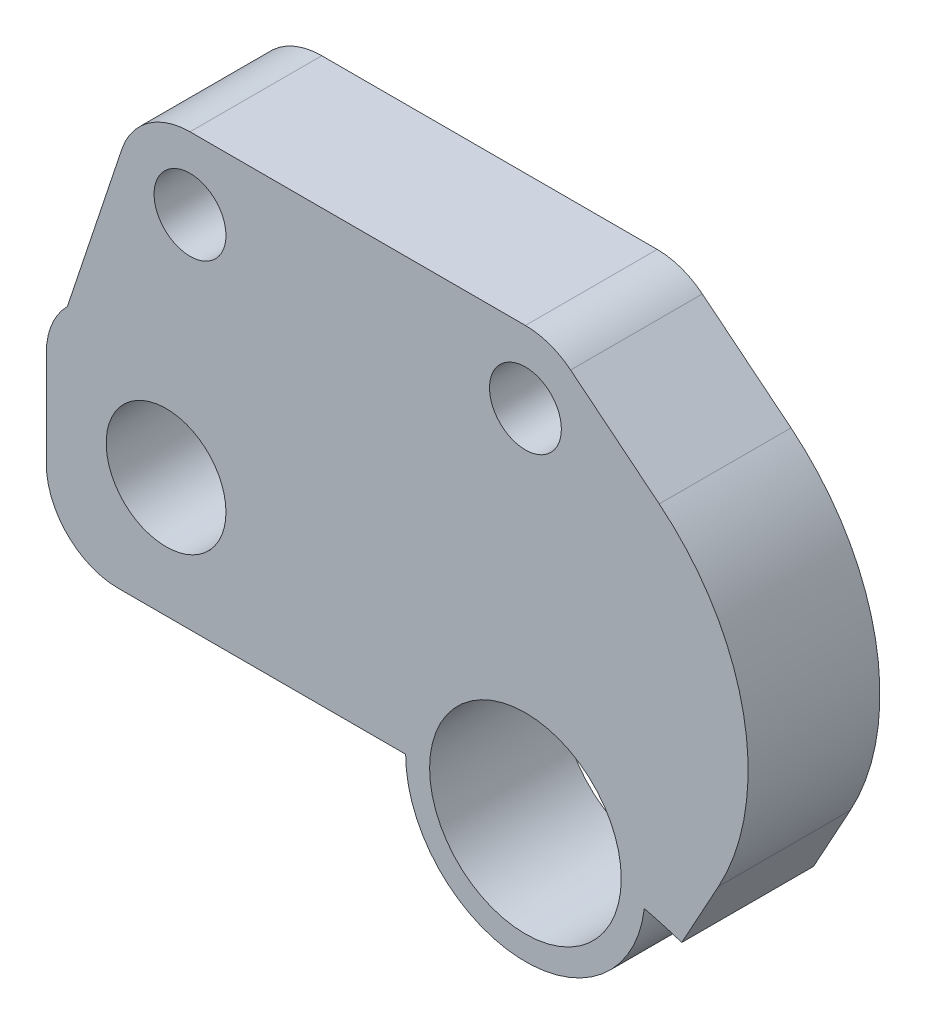
ISO-10303-21;
HEADER;
FILE_DESCRIPTION(('STEP AP214'),'2;1');
FILE_NAME('part.step','',(''),(''),'','','');
FILE_SCHEMA(('AUTOMOTIVE_DESIGN { 1 0 10303 214 1 1 1 1 }'));
ENDSEC;
DATA;
#1=APPLICATION_CONTEXT('core data for automotive mechanical design processes');
#2=APPLICATION_PROTOCOL_DEFINITION('international standard','automotive_design',2000,#1);
#3=PRODUCT_CONTEXT('',#1,'mechanical');
#4=PRODUCT('Part','Part','',(#3));
#5=PRODUCT_RELATED_PRODUCT_CATEGORY('part','',(#4));
#6=PRODUCT_DEFINITION_FORMATION('','',#4);
#7=PRODUCT_DEFINITION_CONTEXT('part definition',#1,'design');
#8=PRODUCT_DEFINITION('design','',#6,#7);
#9=PRODUCT_DEFINITION_SHAPE('','',#8);
#10=(LENGTH_UNIT() NAMED_UNIT(*) SI_UNIT(.MILLI.,.METRE.));
#11=(NAMED_UNIT(*) PLANE_ANGLE_UNIT() SI_UNIT($,.RADIAN.));
#12=(NAMED_UNIT(*) SI_UNIT($,.STERADIAN.) SOLID_ANGLE_UNIT());
#13=UNCERTAINTY_MEASURE_WITH_UNIT(LENGTH_MEASURE(1.E-05),#10,'distance_accuracy_value','');
#14=(GEOMETRIC_REPRESENTATION_CONTEXT(3) GLOBAL_UNCERTAINTY_ASSIGNED_CONTEXT((#13)) GLOBAL_UNIT_ASSIGNED_CONTEXT((#10,
#11,#12)) REPRESENTATION_CONTEXT('',''));
#15=CARTESIAN_POINT('',(0.,0.,0.));
#16=DIRECTION('',(0.,0.,1.));
#17=DIRECTION('',(1.,0.,0.));
#18=AXIS2_PLACEMENT_3D('',#15,#16,#17);
#19=CARTESIAN_POINT('',(0.,0.,5.5));
#20=DIRECTION('',(0.,0.,-1.));
#21=DIRECTION('',(-1.,0.,0.));
#22=AXIS2_PLACEMENT_3D('',#19,#20,#21);
#23=CYLINDRICAL_SURFACE('',#22,20.95);
#24=CARTESIAN_POINT('',(0.,0.,0.));
#25=DIRECTION('',(0.,0.,1.));
#26=DIRECTION('',(1.,0.,0.));
#27=AXIS2_PLACEMENT_3D('',#24,#25,#26);
#28=CIRCLE('',#27,20.95);
#29=CARTESIAN_POINT('',(6.52630372987979,19.90753273576,0.));
#30=VERTEX_POINT('',#29);
#31=CARTESIAN_POINT('',(4.96427219059639,20.3533412887828,0.));
#32=VERTEX_POINT('',#31);
#33=EDGE_CURVE('E143',#30,#32,#28,.T.);
#34=ORIENTED_EDGE('',*,*,#33,.F.);
#35=DIRECTION('',(0.,0.,1.));
#36=VECTOR('',#35,1.);
#37=CARTESIAN_POINT('',(6.52630372987979,19.90753273576,-4.5));
#38=LINE('',#37,#36);
#39=CARTESIAN_POINT('',(6.52630372987979,19.90753273576,5.5));
#40=VERTEX_POINT('',#39);
#41=EDGE_CURVE('E132',#30,#40,#38,.T.);
#42=ORIENTED_EDGE('',*,*,#41,.T.);
#43=CARTESIAN_POINT('',(0.,0.,5.5));
#44=DIRECTION('',(0.,0.,1.));
#45=DIRECTION('',(1.,0.,0.));
#46=AXIS2_PLACEMENT_3D('',#43,#44,#45);
#47=CIRCLE('',#46,20.95);
#48=CARTESIAN_POINT('',(4.96427219059639,20.3533412887828,5.5));
#49=VERTEX_POINT('',#48);
#50=EDGE_CURVE('E141',#40,#49,#47,.T.);
#51=ORIENTED_EDGE('',*,*,#50,.T.);
#52=DIRECTION('',(0.,0.,-1.));
#53=VECTOR('',#52,1.);
#54=CARTESIAN_POINT('',(4.96427219059639,20.3533412887828,5.5));
#55=LINE('',#54,#53);
#56=EDGE_CURVE('E189',#49,#32,#55,.T.);
#57=ORIENTED_EDGE('',*,*,#56,.T.);
#58=EDGE_LOOP('',(#34,#42,#51,#57));
#59=FACE_BOUND('',#58,.T.);
#60=ADVANCED_FACE('F34',(#59),#23,.F.);
#61=CARTESIAN_POINT('',(19.4651242928461,24.0626564673157,5.5));
#62=DIRECTION('',(0.628921624970796,0.777468706536857,0.));
#63=DIRECTION('',(-0.777468706536857,0.628921624970796,0.));
#64=AXIS2_PLACEMENT_3D('',#61,#62,#63);
#65=PLANE('',#64);
#66=DIRECTION('',(0.777468706536857,-0.628921624970796,0.));
#67=VECTOR('',#66,1.);
#68=CARTESIAN_POINT('',(19.4651242928461,24.0626564673157,5.5));
#69=LINE('',#68,#67);
#70=CARTESIAN_POINT('',(1.88676487491238,38.2824061196106,5.5));
#71=VERTEX_POINT('',#70);
#72=CARTESIAN_POINT('',(5.58539292199624,35.2904565504812,5.5));
#73=VERTEX_POINT('',#72);
#74=EDGE_CURVE('E151',#71,#73,#69,.T.);
#75=ORIENTED_EDGE('',*,*,#74,.T.);
#76=DIRECTION('',(0.,0.,1.));
#77=VECTOR('',#76,1.);
#78=CARTESIAN_POINT('',(5.58539292199625,35.2904565504812,5.5));
#79=LINE('',#78,#77);
#80=CARTESIAN_POINT('',(5.58539292199624,35.2904565504812,0.));
#81=VERTEX_POINT('',#80);
#82=EDGE_CURVE('E42',#73,#81,#79,.F.);
#83=ORIENTED_EDGE('',*,*,#82,.T.);
#84=DIRECTION('',(0.777468706536857,-0.628921624970796,0.));
#85=VECTOR('',#84,1.);
#86=CARTESIAN_POINT('',(19.4651242928461,24.0626564673157,0.));
#87=LINE('',#86,#85);
#88=CARTESIAN_POINT('',(1.88676487491238,38.2824061196106,0.));
#89=VERTEX_POINT('',#88);
#90=EDGE_CURVE('E196',#89,#81,#87,.T.);
#91=ORIENTED_EDGE('',*,*,#90,.F.);
#92=DIRECTION('',(0.,0.,-1.));
#93=VECTOR('',#92,1.);
#94=CARTESIAN_POINT('',(1.88676487491238,38.2824061196106,5.5));
#95=LINE('',#94,#93);
#96=EDGE_CURVE('E250',#71,#89,#95,.T.);
#97=ORIENTED_EDGE('',*,*,#96,.F.);
#98=EDGE_LOOP('',(#75,#83,#91,#97));
#99=FACE_BOUND('',#98,.T.);
#100=ADVANCED_FACE('F260',(#99),#65,.T.);
#101=CARTESIAN_POINT('',(0.,0.,5.5));
#102=DIRECTION('',(0.,0.,1.));
#103=DIRECTION('',(1.,0.,0.));
#104=AXIS2_PLACEMENT_3D('',#101,#102,#103);
#105=PLANE('',#104);
#106=CARTESIAN_POINT('',(-15.,25.95,5.5));
#107=DIRECTION('',(0.,0.,1.));
#108=DIRECTION('',(1.,0.,0.));
#109=AXIS2_PLACEMENT_3D('',#106,#107,#108);
#110=CIRCLE('',#109,2.5);
#111=CARTESIAN_POINT('',(-12.5,25.95,5.5));
#112=VERTEX_POINT('',#111);
#113=EDGE_CURVE('E157',#112,#112,#110,.T.);
#114=ORIENTED_EDGE('',*,*,#113,.F.);
#115=EDGE_LOOP('',(#114));
#116=FACE_BOUND('',#115,.T.);
#117=CARTESIAN_POINT('',(0.,20.95,5.5));
#118=DIRECTION('',(0.,0.,1.));
#119=DIRECTION('',(1.,0.,0.));
#120=AXIS2_PLACEMENT_3D('',#117,#118,#119);
#121=CIRCLE('',#120,4.);
#122=CARTESIAN_POINT('',(4.,20.95,5.5));
#123=VERTEX_POINT('',#122);
#124=EDGE_CURVE('E152',#123,#123,#121,.T.);
#125=ORIENTED_EDGE('',*,*,#124,.F.);
#126=EDGE_LOOP('',(#125));
#127=FACE_BOUND('',#126,.T.);
#128=CARTESIAN_POINT('',(-14.,35.95,5.5));
#129=DIRECTION('',(0.,0.,1.));
#130=DIRECTION('',(1.,0.,0.));
#131=AXIS2_PLACEMENT_3D('',#128,#129,#130);
#132=CIRCLE('',#131,1.5);
#133=CARTESIAN_POINT('',(-12.5,35.95,5.5));
#134=VERTEX_POINT('',#133);
#135=EDGE_CURVE('E183',#134,#134,#132,.T.);
#136=ORIENTED_EDGE('',*,*,#135,.F.);
#137=EDGE_LOOP('',(#136));
#138=FACE_BOUND('',#137,.T.);
#139=CARTESIAN_POINT('',(0.,35.95,5.5));
#140=DIRECTION('',(0.,0.,1.));
#141=DIRECTION('',(1.,0.,0.));
#142=AXIS2_PLACEMENT_3D('',#139,#140,#141);
#143=CIRCLE('',#142,1.5);
#144=CARTESIAN_POINT('',(1.5,35.95,5.5));
#145=VERTEX_POINT('',#144);
#146=EDGE_CURVE('E186',#145,#145,#143,.T.);
#147=ORIENTED_EDGE('',*,*,#146,.F.);
#148=EDGE_LOOP('',(#147));
#149=FACE_BOUND('',#148,.T.);
#150=DIRECTION('',(0.481449788710893,0.876473673848928,0.));
#151=VECTOR('',#150,1.);
#152=CARTESIAN_POINT('',(-3.38699580250888,1.86048761318945,5.5));
#153=LINE('',#152,#151);
#154=CARTESIAN_POINT('',(8.06091341077757,22.7012715980037,5.5));
#155=VERTEX_POINT('',#154);
#156=EDGE_CURVE('E128',#40,#155,#153,.T.);
#157=ORIENTED_EDGE('',*,*,#156,.T.);
#158=CARTESIAN_POINT('',(-0.703823327711713,27.5157694851126,5.5));
#159=DIRECTION('',(0.,0.,1.));
#160=DIRECTION('',(1.,0.,0.));
#161=AXIS2_PLACEMENT_3D('',#158,#159,#160);
#162=CIRCLE('',#161,10.);
#163=EDGE_CURVE('E56',#155,#73,#162,.T.);
#164=ORIENTED_EDGE('',*,*,#163,.T.);
#165=ORIENTED_EDGE('',*,*,#74,.F.);
#166=CARTESIAN_POINT('',(0.,35.95,5.5));
#167=DIRECTION('',(0.,0.,1.));
#168=DIRECTION('',(1.,0.,0.));
#169=AXIS2_PLACEMENT_3D('',#166,#167,#168);
#170=CIRCLE('',#169,3.);
#171=CARTESIAN_POINT('',(0.,38.95,5.5));
#172=VERTEX_POINT('',#171);
#173=EDGE_CURVE('E154',#71,#172,#170,.T.);
#174=ORIENTED_EDGE('',*,*,#173,.T.);
#175=DIRECTION('',(1.,0.,0.));
#176=VECTOR('',#175,1.);
#177=CARTESIAN_POINT('',(0.,38.95,5.5));
#178=LINE('',#177,#176);
#179=CARTESIAN_POINT('',(-14.,38.95,5.5));
#180=VERTEX_POINT('',#179);
#181=EDGE_CURVE('E162',#180,#172,#178,.T.);
#182=ORIENTED_EDGE('',*,*,#181,.F.);
#183=CARTESIAN_POINT('',(-14.,35.95,5.5));
#184=DIRECTION('',(0.,0.,1.));
#185=DIRECTION('',(1.,0.,0.));
#186=AXIS2_PLACEMENT_3D('',#183,#184,#185);
#187=CIRCLE('',#186,3.);
#188=CARTESIAN_POINT('',(-16.846114570079,36.8984892482173,5.5));
#189=VERTEX_POINT('',#188);
#190=EDGE_CURVE('E165',#180,#189,#187,.T.);
#191=ORIENTED_EDGE('',*,*,#190,.T.);
#192=DIRECTION('',(-0.316163082739092,-0.948704856693015,0.));
#193=VECTOR('',#192,1.);
#194=CARTESIAN_POINT('',(-26.2297262447128,8.7412550388306,5.5));
#195=LINE('',#194,#193);
#196=CARTESIAN_POINT('',(-19.1213203435596,30.0713203435596,5.5));
#197=VERTEX_POINT('',#196);
#198=EDGE_CURVE('E168',#189,#197,#195,.T.);
#199=ORIENTED_EDGE('',*,*,#198,.T.);
#200=CARTESIAN_POINT('',(-17.,27.95,5.5));
#201=DIRECTION('',(0.,0.,1.));
#202=DIRECTION('',(1.,0.,0.));
#203=AXIS2_PLACEMENT_3D('',#200,#201,#202);
#204=CIRCLE('',#203,3.);
#205=CARTESIAN_POINT('',(-20.,27.95,5.5));
#206=VERTEX_POINT('',#205);
#207=EDGE_CURVE('E171',#197,#206,#204,.T.);
#208=ORIENTED_EDGE('',*,*,#207,.T.);
#209=DIRECTION('',(0.,1.,0.));
#210=VECTOR('',#209,1.);
#211=CARTESIAN_POINT('',(-20.,0.,5.5));
#212=LINE('',#211,#210);
#213=CARTESIAN_POINT('',(-20.,23.95,5.5));
#214=VERTEX_POINT('',#213);
#215=EDGE_CURVE('E173',#214,#206,#212,.T.);
#216=ORIENTED_EDGE('',*,*,#215,.F.);
#217=CARTESIAN_POINT('',(-17.,23.95,5.5));
#218=DIRECTION('',(0.,0.,1.));
#219=DIRECTION('',(1.,0.,0.));
#220=AXIS2_PLACEMENT_3D('',#217,#218,#219);
#221=CIRCLE('',#220,3.);
#222=CARTESIAN_POINT('',(-17.,20.95,5.5));
#223=VERTEX_POINT('',#222);
#224=EDGE_CURVE('E176',#223,#214,#221,.F.);
#225=ORIENTED_EDGE('',*,*,#224,.F.);
#226=DIRECTION('',(-1.,0.,0.));
#227=VECTOR('',#226,1.);
#228=CARTESIAN_POINT('',(0.,20.95,5.5));
#229=LINE('',#228,#227);
#230=CARTESIAN_POINT('',(-5.,20.95,5.5));
#231=VERTEX_POINT('',#230);
#232=EDGE_CURVE('E179',#231,#223,#229,.T.);
#233=ORIENTED_EDGE('',*,*,#232,.F.);
#234=CARTESIAN_POINT('',(0.,20.95,5.5));
#235=DIRECTION('',(0.,0.,1.));
#236=DIRECTION('',(1.,0.,0.));
#237=AXIS2_PLACEMENT_3D('',#234,#235,#236);
#238=CIRCLE('',#237,5.);
#239=EDGE_CURVE('E149',#231,#49,#238,.T.);
#240=ORIENTED_EDGE('',*,*,#239,.T.);
#241=ORIENTED_EDGE('',*,*,#50,.F.);
#242=EDGE_LOOP('',(#157,#164,#165,#174,#182,#191,#199,#208,#216,#225,#233,#240,#241));
#243=FACE_BOUND('',#242,.T.);
#244=ADVANCED_FACE('F146',(#116,#127,#138,#149,#243),#105,.T.);
#245=CARTESIAN_POINT('',(0.,0.,0.));
#246=DIRECTION('',(0.,0.,1.));
#247=DIRECTION('',(1.,0.,0.));
#248=AXIS2_PLACEMENT_3D('',#245,#246,#247);
#249=PLANE('',#248);
#250=CARTESIAN_POINT('',(0.,35.95,0.));
#251=DIRECTION('',(0.,0.,1.));
#252=DIRECTION('',(1.,0.,0.));
#253=AXIS2_PLACEMENT_3D('',#250,#251,#252);
#254=CIRCLE('',#253,1.5);
#255=CARTESIAN_POINT('',(1.5,35.95,0.));
#256=VERTEX_POINT('',#255);
#257=EDGE_CURVE('E228',#256,#256,#254,.T.);
#258=ORIENTED_EDGE('',*,*,#257,.T.);
#259=EDGE_LOOP('',(#258));
#260=FACE_BOUND('',#259,.T.);
#261=CARTESIAN_POINT('',(-14.,35.95,0.));
#262=DIRECTION('',(0.,0.,1.));
#263=DIRECTION('',(1.,0.,0.));
#264=AXIS2_PLACEMENT_3D('',#261,#262,#263);
#265=CIRCLE('',#264,1.5);
#266=CARTESIAN_POINT('',(-12.5,35.95,0.));
#267=VERTEX_POINT('',#266);
#268=EDGE_CURVE('E225',#267,#267,#265,.T.);
#269=ORIENTED_EDGE('',*,*,#268,.T.);
#270=EDGE_LOOP('',(#269));
#271=FACE_BOUND('',#270,.T.);
#272=CARTESIAN_POINT('',(0.,20.95,0.));
#273=DIRECTION('',(0.,0.,1.));
#274=DIRECTION('',(1.,0.,0.));
#275=AXIS2_PLACEMENT_3D('',#272,#273,#274);
#276=CIRCLE('',#275,4.);
#277=CARTESIAN_POINT('',(4.,20.95,0.));
#278=VERTEX_POINT('',#277);
#279=EDGE_CURVE('E192',#278,#278,#276,.T.);
#280=ORIENTED_EDGE('',*,*,#279,.T.);
#281=EDGE_LOOP('',(#280));
#282=FACE_BOUND('',#281,.T.);
#283=CARTESIAN_POINT('',(-15.,25.95,0.));
#284=DIRECTION('',(0.,0.,1.));
#285=DIRECTION('',(1.,0.,0.));
#286=AXIS2_PLACEMENT_3D('',#283,#284,#285);
#287=CIRCLE('',#286,2.5);
#288=CARTESIAN_POINT('',(-12.5,25.95,0.));
#289=VERTEX_POINT('',#288);
#290=EDGE_CURVE('E144',#289,#289,#287,.T.);
#291=ORIENTED_EDGE('',*,*,#290,.T.);
#292=EDGE_LOOP('',(#291));
#293=FACE_BOUND('',#292,.T.);
#294=ORIENTED_EDGE('',*,*,#90,.T.);
#295=CARTESIAN_POINT('',(-0.703823327711713,27.5157694851126,0.));
#296=DIRECTION('',(0.,0.,1.));
#297=DIRECTION('',(1.,0.,0.));
#298=AXIS2_PLACEMENT_3D('',#295,#296,#297);
#299=CIRCLE('',#298,10.);
#300=CARTESIAN_POINT('',(8.06091341077757,22.7012715980037,0.));
#301=VERTEX_POINT('',#300);
#302=EDGE_CURVE('E11',#81,#301,#299,.F.);
#303=ORIENTED_EDGE('',*,*,#302,.T.);
#304=DIRECTION('',(0.481449788710893,0.876473673848928,0.));
#305=VECTOR('',#304,1.);
#306=CARTESIAN_POINT('',(-3.38699580250888,1.86048761318945,0.));
#307=LINE('',#306,#305);
#308=EDGE_CURVE('E252',#30,#301,#307,.T.);
#309=ORIENTED_EDGE('',*,*,#308,.F.);
#310=ORIENTED_EDGE('',*,*,#33,.T.);
#311=CARTESIAN_POINT('',(0.,20.95,0.));
#312=DIRECTION('',(0.,0.,1.));
#313=DIRECTION('',(1.,0.,0.));
#314=AXIS2_PLACEMENT_3D('',#311,#312,#313);
#315=CIRCLE('',#314,5.);
#316=CARTESIAN_POINT('',(-5.,20.95,0.));
#317=VERTEX_POINT('',#316);
#318=EDGE_CURVE('E222',#317,#32,#315,.T.);
#319=ORIENTED_EDGE('',*,*,#318,.F.);
#320=DIRECTION('',(-1.,0.,0.));
#321=VECTOR('',#320,1.);
#322=CARTESIAN_POINT('',(0.,20.95,0.));
#323=LINE('',#322,#321);
#324=CARTESIAN_POINT('',(-17.,20.95,0.));
#325=VERTEX_POINT('',#324);
#326=EDGE_CURVE('E219',#317,#325,#323,.T.);
#327=ORIENTED_EDGE('',*,*,#326,.T.);
#328=CARTESIAN_POINT('',(-17.,23.95,0.));
#329=DIRECTION('',(0.,0.,1.));
#330=DIRECTION('',(1.,0.,0.));
#331=AXIS2_PLACEMENT_3D('',#328,#329,#330);
#332=CIRCLE('',#331,3.);
#333=CARTESIAN_POINT('',(-20.,23.95,0.));
#334=VERTEX_POINT('',#333);
#335=EDGE_CURVE('E216',#325,#334,#332,.F.);
#336=ORIENTED_EDGE('',*,*,#335,.T.);
#337=DIRECTION('',(0.,1.,0.));
#338=VECTOR('',#337,1.);
#339=CARTESIAN_POINT('',(-20.,0.,0.));
#340=LINE('',#339,#338);
#341=CARTESIAN_POINT('',(-20.,27.95,0.));
#342=VERTEX_POINT('',#341);
#343=EDGE_CURVE('E213',#334,#342,#340,.T.);
#344=ORIENTED_EDGE('',*,*,#343,.T.);
#345=CARTESIAN_POINT('',(-17.,27.95,0.));
#346=DIRECTION('',(0.,0.,1.));
#347=DIRECTION('',(1.,0.,0.));
#348=AXIS2_PLACEMENT_3D('',#345,#346,#347);
#349=CIRCLE('',#348,3.);
#350=CARTESIAN_POINT('',(-19.1213203435596,30.0713203435596,0.));
#351=VERTEX_POINT('',#350);
#352=EDGE_CURVE('E210',#351,#342,#349,.T.);
#353=ORIENTED_EDGE('',*,*,#352,.F.);
#354=DIRECTION('',(-0.316163082739092,-0.948704856693015,0.));
#355=VECTOR('',#354,1.);
#356=CARTESIAN_POINT('',(-26.2297262447128,8.7412550388306,0.));
#357=LINE('',#356,#355);
#358=CARTESIAN_POINT('',(-16.846114570079,36.8984892482173,0.));
#359=VERTEX_POINT('',#358);
#360=EDGE_CURVE('E207',#359,#351,#357,.T.);
#361=ORIENTED_EDGE('',*,*,#360,.F.);
#362=CARTESIAN_POINT('',(-14.,35.95,0.));
#363=DIRECTION('',(0.,0.,1.));
#364=DIRECTION('',(1.,0.,0.));
#365=AXIS2_PLACEMENT_3D('',#362,#363,#364);
#366=CIRCLE('',#365,3.);
#367=CARTESIAN_POINT('',(-14.,38.95,0.));
#368=VERTEX_POINT('',#367);
#369=EDGE_CURVE('E204',#368,#359,#366,.T.);
#370=ORIENTED_EDGE('',*,*,#369,.F.);
#371=DIRECTION('',(1.,0.,0.));
#372=VECTOR('',#371,1.);
#373=CARTESIAN_POINT('',(0.,38.95,0.));
#374=LINE('',#373,#372);
#375=CARTESIAN_POINT('',(0.,38.95,0.));
#376=VERTEX_POINT('',#375);
#377=EDGE_CURVE('E201',#368,#376,#374,.T.);
#378=ORIENTED_EDGE('',*,*,#377,.T.);
#379=CARTESIAN_POINT('',(0.,35.95,0.));
#380=DIRECTION('',(0.,0.,1.));
#381=DIRECTION('',(1.,0.,0.));
#382=AXIS2_PLACEMENT_3D('',#379,#380,#381);
#383=CIRCLE('',#382,3.);
#384=EDGE_CURVE('E198',#89,#376,#383,.T.);
#385=ORIENTED_EDGE('',*,*,#384,.F.);
#386=EDGE_LOOP('',(#294,#303,#309,#310,#319,#327,#336,#344,#353,#361,#370,#378,#385));
#387=FACE_BOUND('',#386,.T.);
#388=ADVANCED_FACE('F258',(#260,#271,#282,#293,#387),#249,.F.);
#389=CARTESIAN_POINT('',(0.,35.95,5.5));
#390=DIRECTION('',(0.,0.,-1.));
#391=DIRECTION('',(-1.,0.,0.));
#392=AXIS2_PLACEMENT_3D('',#389,#390,#391);
#393=CYLINDRICAL_SURFACE('',#392,3.);
#394=ORIENTED_EDGE('',*,*,#384,.T.);
#395=DIRECTION('',(0.,0.,-1.));
#396=VECTOR('',#395,1.);
#397=CARTESIAN_POINT('',(0.,38.95,5.5));
#398=LINE('',#397,#396);
#399=EDGE_CURVE('E248',#172,#376,#398,.T.);
#400=ORIENTED_EDGE('',*,*,#399,.F.);
#401=ORIENTED_EDGE('',*,*,#173,.F.);
#402=ORIENTED_EDGE('',*,*,#96,.T.);
#403=EDGE_LOOP('',(#394,#400,#401,#402));
#404=FACE_BOUND('',#403,.T.);
#405=ADVANCED_FACE('F264',(#404),#393,.T.);
#406=CARTESIAN_POINT('',(0.,38.95,5.5));
#407=DIRECTION('',(0.,1.,0.));
#408=DIRECTION('',(0.,0.,1.));
#409=AXIS2_PLACEMENT_3D('',#406,#407,#408);
#410=PLANE('',#409);
#411=ORIENTED_EDGE('',*,*,#377,.F.);
#412=DIRECTION('',(0.,0.,-1.));
#413=VECTOR('',#412,1.);
#414=CARTESIAN_POINT('',(-14.,38.95,5.5));
#415=LINE('',#414,#413);
#416=EDGE_CURVE('E246',#180,#368,#415,.T.);
#417=ORIENTED_EDGE('',*,*,#416,.F.);
#418=ORIENTED_EDGE('',*,*,#181,.T.);
#419=ORIENTED_EDGE('',*,*,#399,.T.);
#420=EDGE_LOOP('',(#411,#417,#418,#419));
#421=FACE_BOUND('',#420,.T.);
#422=ADVANCED_FACE('F270',(#421),#410,.T.);
#423=CARTESIAN_POINT('',(-14.,35.95,5.5));
#424=DIRECTION('',(0.,0.,-1.));
#425=DIRECTION('',(-1.,0.,0.));
#426=AXIS2_PLACEMENT_3D('',#423,#424,#425);
#427=CYLINDRICAL_SURFACE('',#426,3.);
#428=ORIENTED_EDGE('',*,*,#369,.T.);
#429=DIRECTION('',(0.,0.,-1.));
#430=VECTOR('',#429,1.);
#431=CARTESIAN_POINT('',(-16.846114570079,36.8984892482173,5.5));
#432=LINE('',#431,#430);
#433=EDGE_CURVE('E243',#189,#359,#432,.T.);
#434=ORIENTED_EDGE('',*,*,#433,.F.);
#435=ORIENTED_EDGE('',*,*,#190,.F.);
#436=ORIENTED_EDGE('',*,*,#416,.T.);
#437=EDGE_LOOP('',(#428,#434,#435,#436));
#438=FACE_BOUND('',#437,.T.);
#439=ADVANCED_FACE('F273',(#438),#427,.T.);
#440=CARTESIAN_POINT('',(-26.2297262447128,8.7412550388306,5.5));
#441=DIRECTION('',(0.948704856693015,-0.316163082739092,0.));
#442=DIRECTION('',(0.316163082739092,0.948704856693015,0.));
#443=AXIS2_PLACEMENT_3D('',#440,#441,#442);
#444=PLANE('',#443);
#445=ORIENTED_EDGE('',*,*,#360,.T.);
#446=DIRECTION('',(0.,0.,-1.));
#447=VECTOR('',#446,1.);
#448=CARTESIAN_POINT('',(-19.1213203435596,30.0713203435596,5.5));
#449=LINE('',#448,#447);
#450=EDGE_CURVE('E240',#197,#351,#449,.T.);
#451=ORIENTED_EDGE('',*,*,#450,.F.);
#452=ORIENTED_EDGE('',*,*,#198,.F.);
#453=ORIENTED_EDGE('',*,*,#433,.T.);
#454=EDGE_LOOP('',(#445,#451,#452,#453));
#455=FACE_BOUND('',#454,.T.);
#456=ADVANCED_FACE('F275',(#455),#444,.F.);
#457=CARTESIAN_POINT('',(-17.,27.95,5.5));
#458=DIRECTION('',(0.,0.,-1.));
#459=DIRECTION('',(-1.,0.,0.));
#460=AXIS2_PLACEMENT_3D('',#457,#458,#459);
#461=CYLINDRICAL_SURFACE('',#460,3.);
#462=ORIENTED_EDGE('',*,*,#352,.T.);
#463=DIRECTION('',(0.,0.,-1.));
#464=VECTOR('',#463,1.);
#465=CARTESIAN_POINT('',(-20.,27.95,5.5));
#466=LINE('',#465,#464);
#467=EDGE_CURVE('E238',#206,#342,#466,.T.);
#468=ORIENTED_EDGE('',*,*,#467,.F.);
#469=ORIENTED_EDGE('',*,*,#207,.F.);
#470=ORIENTED_EDGE('',*,*,#450,.T.);
#471=EDGE_LOOP('',(#462,#468,#469,#470));
#472=FACE_BOUND('',#471,.T.);
#473=ADVANCED_FACE('F281',(#472),#461,.T.);
#474=CARTESIAN_POINT('',(-20.,0.,5.5));
#475=DIRECTION('',(-1.,0.,0.));
#476=DIRECTION('',(0.,0.,1.));
#477=AXIS2_PLACEMENT_3D('',#474,#475,#476);
#478=PLANE('',#477);
#479=ORIENTED_EDGE('',*,*,#343,.F.);
#480=DIRECTION('',(0.,0.,-1.));
#481=VECTOR('',#480,1.);
#482=CARTESIAN_POINT('',(-20.,23.95,5.5));
#483=LINE('',#482,#481);
#484=EDGE_CURVE('E236',#214,#334,#483,.T.);
#485=ORIENTED_EDGE('',*,*,#484,.F.);
#486=ORIENTED_EDGE('',*,*,#215,.T.);
#487=ORIENTED_EDGE('',*,*,#467,.T.);
#488=EDGE_LOOP('',(#479,#485,#486,#487));
#489=FACE_BOUND('',#488,.T.);
#490=ADVANCED_FACE('F284',(#489),#478,.T.);
#491=CARTESIAN_POINT('',(-17.,23.95,5.5));
#492=DIRECTION('',(0.,0.,-1.));
#493=DIRECTION('',(-1.,0.,0.));
#494=AXIS2_PLACEMENT_3D('',#491,#492,#493);
#495=CYLINDRICAL_SURFACE('',#494,3.);
#496=ORIENTED_EDGE('',*,*,#335,.F.);
#497=DIRECTION('',(0.,0.,-1.));
#498=VECTOR('',#497,1.);
#499=CARTESIAN_POINT('',(-17.,20.95,5.5));
#500=LINE('',#499,#498);
#501=EDGE_CURVE('E234',#223,#325,#500,.T.);
#502=ORIENTED_EDGE('',*,*,#501,.F.);
#503=ORIENTED_EDGE('',*,*,#224,.T.);
#504=ORIENTED_EDGE('',*,*,#484,.T.);
#505=EDGE_LOOP('',(#496,#502,#503,#504));
#506=FACE_BOUND('',#505,.T.);
#507=ADVANCED_FACE('F287',(#506),#495,.T.);
#508=CARTESIAN_POINT('',(0.,20.95,5.5));
#509=DIRECTION('',(0.,-1.,0.));
#510=DIRECTION('',(1.,0.,0.));
#511=AXIS2_PLACEMENT_3D('',#508,#509,#510);
#512=PLANE('',#511);
#513=ORIENTED_EDGE('',*,*,#326,.F.);
#514=DIRECTION('',(0.,0.,-1.));
#515=VECTOR('',#514,1.);
#516=CARTESIAN_POINT('',(-5.,20.95,5.5));
#517=LINE('',#516,#515);
#518=EDGE_CURVE('E232',#231,#317,#517,.T.);
#519=ORIENTED_EDGE('',*,*,#518,.F.);
#520=ORIENTED_EDGE('',*,*,#232,.T.);
#521=ORIENTED_EDGE('',*,*,#501,.T.);
#522=EDGE_LOOP('',(#513,#519,#520,#521));
#523=FACE_BOUND('',#522,.T.);
#524=ADVANCED_FACE('F290',(#523),#512,.T.);
#525=CARTESIAN_POINT('',(-14.,35.95,5.5));
#526=DIRECTION('',(0.,0.,-1.));
#527=DIRECTION('',(-1.,0.,0.));
#528=AXIS2_PLACEMENT_3D('',#525,#526,#527);
#529=CYLINDRICAL_SURFACE('',#528,1.5);
#530=ORIENTED_EDGE('',*,*,#135,.T.);
#531=EDGE_LOOP('',(#530));
#532=FACE_BOUND('',#531,.T.);
#533=ORIENTED_EDGE('',*,*,#268,.F.);
#534=EDGE_LOOP('',(#533));
#535=FACE_BOUND('',#534,.T.);
#536=ADVANCED_FACE('F296',(#532,#535),#529,.F.);
#537=CARTESIAN_POINT('',(0.,20.95,5.5));
#538=DIRECTION('',(0.,0.,-1.));
#539=DIRECTION('',(-1.,0.,0.));
#540=AXIS2_PLACEMENT_3D('',#537,#538,#539);
#541=CYLINDRICAL_SURFACE('',#540,5.);
#542=ORIENTED_EDGE('',*,*,#318,.T.);
#543=ORIENTED_EDGE('',*,*,#56,.F.);
#544=ORIENTED_EDGE('',*,*,#239,.F.);
#545=ORIENTED_EDGE('',*,*,#518,.T.);
#546=EDGE_LOOP('',(#542,#543,#544,#545));
#547=FACE_BOUND('',#546,.T.);
#548=ADVANCED_FACE('F293',(#547),#541,.T.);
#549=CARTESIAN_POINT('',(0.,20.95,5.5));
#550=DIRECTION('',(0.,0.,-1.));
#551=DIRECTION('',(-1.,0.,0.));
#552=AXIS2_PLACEMENT_3D('',#549,#550,#551);
#553=CYLINDRICAL_SURFACE('',#552,4.);
#554=ORIENTED_EDGE('',*,*,#124,.T.);
#555=EDGE_LOOP('',(#554));
#556=FACE_BOUND('',#555,.T.);
#557=ORIENTED_EDGE('',*,*,#279,.F.);
#558=EDGE_LOOP('',(#557));
#559=FACE_BOUND('',#558,.T.);
#560=ADVANCED_FACE('F295',(#556,#559),#553,.F.);
#561=CARTESIAN_POINT('',(-15.,25.95,5.5));
#562=DIRECTION('',(0.,0.,-1.));
#563=DIRECTION('',(-1.,0.,0.));
#564=AXIS2_PLACEMENT_3D('',#561,#562,#563);
#565=CYLINDRICAL_SURFACE('',#564,2.5);
#566=ORIENTED_EDGE('',*,*,#113,.T.);
#567=EDGE_LOOP('',(#566));
#568=FACE_BOUND('',#567,.T.);
#569=ORIENTED_EDGE('',*,*,#290,.F.);
#570=EDGE_LOOP('',(#569));
#571=FACE_BOUND('',#570,.T.);
#572=ADVANCED_FACE('F302',(#568,#571),#565,.F.);
#573=CARTESIAN_POINT('',(0.,35.95,5.5));
#574=DIRECTION('',(0.,0.,-1.));
#575=DIRECTION('',(-1.,0.,0.));
#576=AXIS2_PLACEMENT_3D('',#573,#574,#575);
#577=CYLINDRICAL_SURFACE('',#576,1.5);
#578=ORIENTED_EDGE('',*,*,#146,.T.);
#579=EDGE_LOOP('',(#578));
#580=FACE_BOUND('',#579,.T.);
#581=ORIENTED_EDGE('',*,*,#257,.F.);
#582=EDGE_LOOP('',(#581));
#583=FACE_BOUND('',#582,.T.);
#584=ADVANCED_FACE('F316',(#580,#583),#577,.F.);
#585=CARTESIAN_POINT('',(-3.38699580250888,1.86048761318945,-4.5));
#586=DIRECTION('',(0.876473673848928,-0.481449788710893,0.));
#587=DIRECTION('',(0.481449788710893,0.876473673848928,0.));
#588=AXIS2_PLACEMENT_3D('',#585,#586,#587);
#589=PLANE('',#588);
#590=ORIENTED_EDGE('',*,*,#308,.T.);
#591=DIRECTION('',(0.,0.,1.));
#592=VECTOR('',#591,1.);
#593=CARTESIAN_POINT('',(8.06091341077757,22.7012715980037,-4.5));
#594=LINE('',#593,#592);
#595=EDGE_CURVE('E135',#301,#155,#594,.T.);
#596=ORIENTED_EDGE('',*,*,#595,.T.);
#597=ORIENTED_EDGE('',*,*,#156,.F.);
#598=ORIENTED_EDGE('',*,*,#41,.F.);
#599=EDGE_LOOP('',(#590,#596,#597,#598));
#600=FACE_BOUND('',#599,.T.);
#601=ADVANCED_FACE('F131',(#600),#589,.T.);
#602=CARTESIAN_POINT('',(-0.703823327711713,27.5157694851126,-4.5));
#603=DIRECTION('',(0.,0.,1.));
#604=DIRECTION('',(1.,0.,0.));
#605=AXIS2_PLACEMENT_3D('',#602,#603,#604);
#606=CYLINDRICAL_SURFACE('',#605,10.);
#607=ORIENTED_EDGE('',*,*,#302,.F.);
#608=ORIENTED_EDGE('',*,*,#82,.F.);
#609=ORIENTED_EDGE('',*,*,#163,.F.);
#610=ORIENTED_EDGE('',*,*,#595,.F.);
#611=EDGE_LOOP('',(#607,#608,#609,#610));
#612=FACE_BOUND('',#611,.T.);
#613=ADVANCED_FACE('F36',(#612),#606,.T.);
#614=CLOSED_SHELL('',(#60,#100,#244,#388,#405,#422,#439,#456,#473,#490,#507,#524,#536,#548,#560,
#572,#584,#601,#613));
#615=MANIFOLD_SOLID_BREP('B2',#614);
#616=ADVANCED_BREP_SHAPE_REPRESENTATION('',(#18,#615),#14);
#617=SHAPE_DEFINITION_REPRESENTATION(#9,#616);
ENDSEC;
END-ISO-10303-21;
